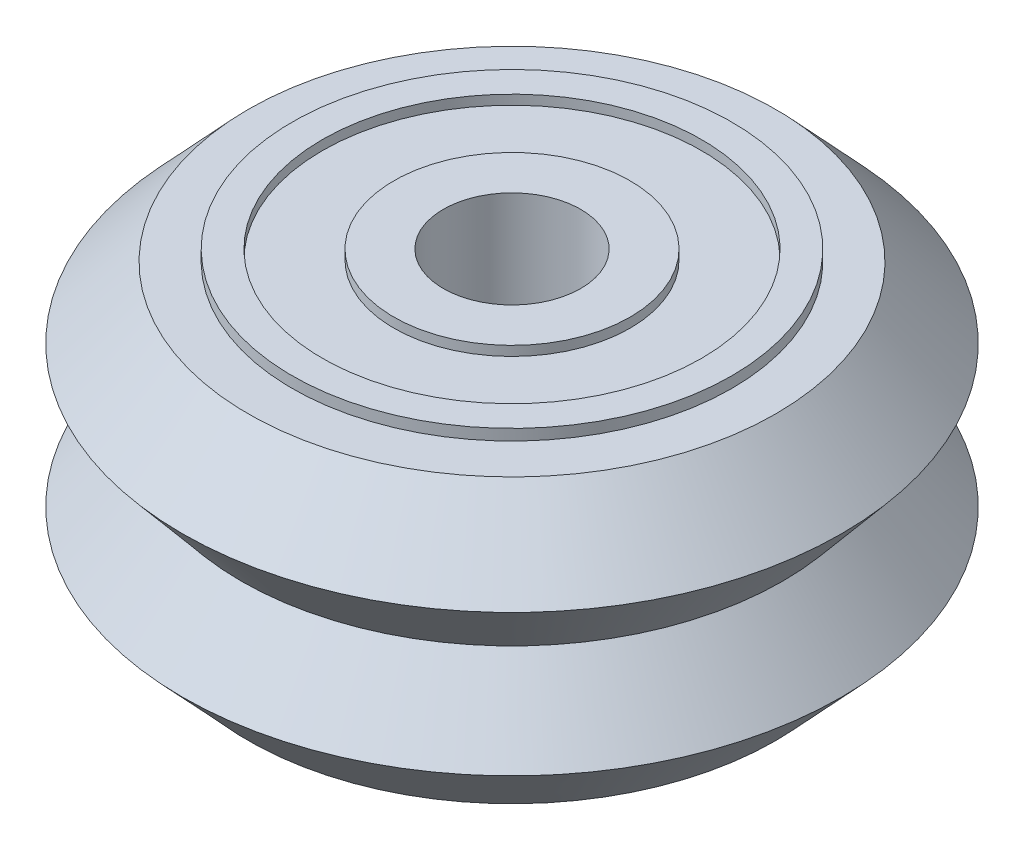
ISO-10303-21;
HEADER;
FILE_DESCRIPTION(('STEP AP214'),'2;1');
FILE_NAME('part.step','',(''),(''),'','','');
FILE_SCHEMA(('AUTOMOTIVE_DESIGN { 1 0 10303 214 1 1 1 1 }'));
ENDSEC;
DATA;
#1=APPLICATION_CONTEXT('core data for automotive mechanical design processes');
#2=APPLICATION_PROTOCOL_DEFINITION('international standard','automotive_design',2000,#1);
#3=PRODUCT_CONTEXT('',#1,'mechanical');
#4=PRODUCT('Part','Part','',(#3));
#5=PRODUCT_RELATED_PRODUCT_CATEGORY('part','',(#4));
#6=PRODUCT_DEFINITION_FORMATION('','',#4);
#7=PRODUCT_DEFINITION_CONTEXT('part definition',#1,'design');
#8=PRODUCT_DEFINITION('design','',#6,#7);
#9=PRODUCT_DEFINITION_SHAPE('','',#8);
#10=(LENGTH_UNIT() NAMED_UNIT(*) SI_UNIT(.MILLI.,.METRE.));
#11=(NAMED_UNIT(*) PLANE_ANGLE_UNIT() SI_UNIT($,.RADIAN.));
#12=(NAMED_UNIT(*) SI_UNIT($,.STERADIAN.) SOLID_ANGLE_UNIT());
#13=UNCERTAINTY_MEASURE_WITH_UNIT(LENGTH_MEASURE(1.E-05),#10,'distance_accuracy_value','');
#14=(GEOMETRIC_REPRESENTATION_CONTEXT(3) GLOBAL_UNCERTAINTY_ASSIGNED_CONTEXT((#13)) GLOBAL_UNIT_ASSIGNED_CONTEXT((#10,
#11,#12)) REPRESENTATION_CONTEXT('',''));
#15=CARTESIAN_POINT('',(0.,0.,0.));
#16=DIRECTION('',(0.,0.,1.));
#17=DIRECTION('',(1.,0.,0.));
#18=AXIS2_PLACEMENT_3D('',#15,#16,#17);
#19=CARTESIAN_POINT('',(0.,-5.55,-8.));
#20=DIRECTION('',(0.,1.,0.));
#21=DIRECTION('',(1.,0.,0.));
#22=AXIS2_PLACEMENT_3D('',#19,#20,#21);
#23=PLANE('',#22);
#24=CARTESIAN_POINT('',(0.,-5.55,0.));
#25=DIRECTION('',(0.,1.,0.));
#26=DIRECTION('',(1.,0.,0.));
#27=AXIS2_PLACEMENT_3D('',#24,#25,#26);
#28=CIRCLE('',#27,8.);
#29=CARTESIAN_POINT('',(8.,-5.55,0.));
#30=VERTEX_POINT('',#29);
#31=EDGE_CURVE('P0_E54',#30,#30,#28,.T.);
#32=ORIENTED_EDGE('',*,*,#31,.F.);
#33=EDGE_LOOP('',(#32));
#34=FACE_BOUND('',#33,.T.);
#35=CARTESIAN_POINT('',(0.,-5.55,0.));
#36=DIRECTION('',(0.,1.,0.));
#37=DIRECTION('',(1.,0.,0.));
#38=AXIS2_PLACEMENT_3D('',#35,#36,#37);
#39=CIRCLE('',#38,6.9);
#40=CARTESIAN_POINT('',(6.9,-5.55,0.));
#41=VERTEX_POINT('',#40);
#42=EDGE_CURVE('P0_E9',#41,#41,#39,.T.);
#43=ORIENTED_EDGE('',*,*,#42,.T.);
#44=EDGE_LOOP('',(#43));
#45=FACE_BOUND('',#44,.T.);
#46=ADVANCED_FACE('P0_F14',(#34,#45),#23,.F.);
#47=CARTESIAN_POINT('',(0.,8.97867383512545,0.));
#48=DIRECTION('',(0.,1.,0.));
#49=DIRECTION('',(1.,0.,0.));
#50=AXIS2_PLACEMENT_3D('',#47,#48,#49);
#51=CYLINDRICAL_SURFACE('',#50,6.9);
#52=ORIENTED_EDGE('',*,*,#42,.F.);
#53=EDGE_LOOP('',(#52));
#54=FACE_BOUND('',#53,.T.);
#55=CARTESIAN_POINT('',(0.,-5.2,0.));
#56=DIRECTION('',(0.,1.,0.));
#57=DIRECTION('',(1.,0.,0.));
#58=AXIS2_PLACEMENT_3D('',#55,#56,#57);
#59=CIRCLE('',#58,6.9);
#60=CARTESIAN_POINT('',(6.9,-5.2,0.));
#61=VERTEX_POINT('',#60);
#62=EDGE_CURVE('P0_E20',#61,#61,#59,.T.);
#63=ORIENTED_EDGE('',*,*,#62,.T.);
#64=EDGE_LOOP('',(#63));
#65=FACE_BOUND('',#64,.T.);
#66=ADVANCED_FACE('P0_F61',(#54,#65),#51,.F.);
#67=CARTESIAN_POINT('',(0.,-5.2,-6.9));
#68=DIRECTION('',(0.,1.,0.));
#69=DIRECTION('',(1.,0.,0.));
#70=AXIS2_PLACEMENT_3D('',#67,#68,#69);
#71=PLANE('',#70);
#72=ORIENTED_EDGE('',*,*,#62,.F.);
#73=EDGE_LOOP('',(#72));
#74=FACE_BOUND('',#73,.T.);
#75=CARTESIAN_POINT('',(0.,-5.2,0.));
#76=DIRECTION('',(0.,1.,0.));
#77=DIRECTION('',(1.,0.,0.));
#78=AXIS2_PLACEMENT_3D('',#75,#76,#77);
#79=CIRCLE('',#78,4.3);
#80=CARTESIAN_POINT('',(4.3,-5.2,0.));
#81=VERTEX_POINT('',#80);
#82=EDGE_CURVE('P0_E24',#81,#81,#79,.T.);
#83=ORIENTED_EDGE('',*,*,#82,.T.);
#84=EDGE_LOOP('',(#83));
#85=FACE_BOUND('',#84,.T.);
#86=ADVANCED_FACE('P0_F66',(#74,#85),#71,.F.);
#87=CARTESIAN_POINT('',(0.,8.97867383512545,0.));
#88=DIRECTION('',(0.,1.,0.));
#89=DIRECTION('',(1.,0.,0.));
#90=AXIS2_PLACEMENT_3D('',#87,#88,#89);
#91=CYLINDRICAL_SURFACE('',#90,4.3);
#92=ORIENTED_EDGE('',*,*,#82,.F.);
#93=EDGE_LOOP('',(#92));
#94=FACE_BOUND('',#93,.T.);
#95=CARTESIAN_POINT('',(0.,-5.55,0.));
#96=DIRECTION('',(0.,1.,0.));
#97=DIRECTION('',(1.,0.,0.));
#98=AXIS2_PLACEMENT_3D('',#95,#96,#97);
#99=CIRCLE('',#98,4.3);
#100=CARTESIAN_POINT('',(4.3,-5.55,0.));
#101=VERTEX_POINT('',#100);
#102=EDGE_CURVE('P0_E28',#101,#101,#99,.T.);
#103=ORIENTED_EDGE('',*,*,#102,.T.);
#104=EDGE_LOOP('',(#103));
#105=FACE_BOUND('',#104,.T.);
#106=ADVANCED_FACE('P0_F71',(#94,#105),#91,.T.);
#107=CARTESIAN_POINT('',(0.,-5.55,-4.3));
#108=DIRECTION('',(0.,1.,0.));
#109=DIRECTION('',(1.,0.,0.));
#110=AXIS2_PLACEMENT_3D('',#107,#108,#109);
#111=PLANE('',#110);
#112=ORIENTED_EDGE('',*,*,#102,.F.);
#113=EDGE_LOOP('',(#112));
#114=FACE_BOUND('',#113,.T.);
#115=CARTESIAN_POINT('',(0.,-5.55,0.));
#116=DIRECTION('',(0.,1.,0.));
#117=DIRECTION('',(1.,0.,0.));
#118=AXIS2_PLACEMENT_3D('',#115,#116,#117);
#119=CIRCLE('',#118,2.5);
#120=CARTESIAN_POINT('',(2.5,-5.55,0.));
#121=VERTEX_POINT('',#120);
#122=EDGE_CURVE('P0_E33',#121,#121,#119,.T.);
#123=ORIENTED_EDGE('',*,*,#122,.T.);
#124=EDGE_LOOP('',(#123));
#125=FACE_BOUND('',#124,.T.);
#126=ADVANCED_FACE('P0_F77',(#114,#125),#111,.F.);
#127=CARTESIAN_POINT('',(0.,8.97867383512545,0.));
#128=DIRECTION('',(0.,1.,0.));
#129=DIRECTION('',(1.,0.,0.));
#130=AXIS2_PLACEMENT_3D('',#127,#128,#129);
#131=CYLINDRICAL_SURFACE('',#130,2.5);
#132=ORIENTED_EDGE('',*,*,#122,.F.);
#133=EDGE_LOOP('',(#132));
#134=FACE_BOUND('',#133,.T.);
#135=CARTESIAN_POINT('',(0.,-0.55,0.));
#136=DIRECTION('',(0.,1.,0.));
#137=DIRECTION('',(1.,0.,0.));
#138=AXIS2_PLACEMENT_3D('',#135,#136,#137);
#139=CIRCLE('',#138,2.5);
#140=CARTESIAN_POINT('',(2.5,-0.55,0.));
#141=VERTEX_POINT('',#140);
#142=EDGE_CURVE('P0_E36',#141,#141,#139,.T.);
#143=ORIENTED_EDGE('',*,*,#142,.T.);
#144=EDGE_LOOP('',(#143));
#145=FACE_BOUND('',#144,.T.);
#146=ADVANCED_FACE('P0_F81',(#134,#145),#131,.F.);
#147=CARTESIAN_POINT('',(0.,-0.549999999999999,-4.3));
#148=DIRECTION('',(0.,-1.,0.));
#149=DIRECTION('',(-1.,0.,0.));
#150=AXIS2_PLACEMENT_3D('',#147,#148,#149);
#151=PLANE('',#150);
#152=ORIENTED_EDGE('',*,*,#142,.F.);
#153=EDGE_LOOP('',(#152));
#154=FACE_BOUND('',#153,.T.);
#155=CARTESIAN_POINT('',(0.,-0.55,0.));
#156=DIRECTION('',(0.,1.,0.));
#157=DIRECTION('',(1.,0.,0.));
#158=AXIS2_PLACEMENT_3D('',#155,#156,#157);
#159=CIRCLE('',#158,4.3);
#160=CARTESIAN_POINT('',(4.3,-0.55,0.));
#161=VERTEX_POINT('',#160);
#162=EDGE_CURVE('P0_E39',#161,#161,#159,.T.);
#163=ORIENTED_EDGE('',*,*,#162,.T.);
#164=EDGE_LOOP('',(#163));
#165=FACE_BOUND('',#164,.T.);
#166=ADVANCED_FACE('P0_F85',(#154,#165),#151,.F.);
#167=CARTESIAN_POINT('',(0.,8.97867383512545,0.));
#168=DIRECTION('',(0.,1.,0.));
#169=DIRECTION('',(1.,0.,0.));
#170=AXIS2_PLACEMENT_3D('',#167,#168,#169);
#171=CYLINDRICAL_SURFACE('',#170,4.3);
#172=ORIENTED_EDGE('',*,*,#162,.F.);
#173=EDGE_LOOP('',(#172));
#174=FACE_BOUND('',#173,.T.);
#175=CARTESIAN_POINT('',(0.,-0.9,0.));
#176=DIRECTION('',(0.,1.,0.));
#177=DIRECTION('',(1.,0.,0.));
#178=AXIS2_PLACEMENT_3D('',#175,#176,#177);
#179=CIRCLE('',#178,4.3);
#180=CARTESIAN_POINT('',(4.3,-0.9,0.));
#181=VERTEX_POINT('',#180);
#182=EDGE_CURVE('P0_E42',#181,#181,#179,.T.);
#183=ORIENTED_EDGE('',*,*,#182,.T.);
#184=EDGE_LOOP('',(#183));
#185=FACE_BOUND('',#184,.T.);
#186=ADVANCED_FACE('P0_F89',(#174,#185),#171,.T.);
#187=CARTESIAN_POINT('',(0.,-0.900000000000001,-6.9));
#188=DIRECTION('',(0.,-1.,0.));
#189=DIRECTION('',(-1.,0.,0.));
#190=AXIS2_PLACEMENT_3D('',#187,#188,#189);
#191=PLANE('',#190);
#192=ORIENTED_EDGE('',*,*,#182,.F.);
#193=EDGE_LOOP('',(#192));
#194=FACE_BOUND('',#193,.T.);
#195=CARTESIAN_POINT('',(0.,-0.9,0.));
#196=DIRECTION('',(0.,1.,0.));
#197=DIRECTION('',(1.,0.,0.));
#198=AXIS2_PLACEMENT_3D('',#195,#196,#197);
#199=CIRCLE('',#198,6.9);
#200=CARTESIAN_POINT('',(6.9,-0.9,0.));
#201=VERTEX_POINT('',#200);
#202=EDGE_CURVE('P0_E45',#201,#201,#199,.T.);
#203=ORIENTED_EDGE('',*,*,#202,.T.);
#204=EDGE_LOOP('',(#203));
#205=FACE_BOUND('',#204,.T.);
#206=ADVANCED_FACE('P0_F93',(#194,#205),#191,.F.);
#207=CARTESIAN_POINT('',(0.,8.97867383512545,0.));
#208=DIRECTION('',(0.,1.,0.));
#209=DIRECTION('',(1.,0.,0.));
#210=AXIS2_PLACEMENT_3D('',#207,#208,#209);
#211=CYLINDRICAL_SURFACE('',#210,6.9);
#212=ORIENTED_EDGE('',*,*,#202,.F.);
#213=EDGE_LOOP('',(#212));
#214=FACE_BOUND('',#213,.T.);
#215=CARTESIAN_POINT('',(0.,-0.55,0.));
#216=DIRECTION('',(0.,1.,0.));
#217=DIRECTION('',(1.,0.,0.));
#218=AXIS2_PLACEMENT_3D('',#215,#216,#217);
#219=CIRCLE('',#218,6.9);
#220=CARTESIAN_POINT('',(6.9,-0.55,0.));
#221=VERTEX_POINT('',#220);
#222=EDGE_CURVE('P0_E48',#221,#221,#219,.T.);
#223=ORIENTED_EDGE('',*,*,#222,.T.);
#224=EDGE_LOOP('',(#223));
#225=FACE_BOUND('',#224,.T.);
#226=ADVANCED_FACE('P0_F97',(#214,#225),#211,.F.);
#227=CARTESIAN_POINT('',(0.,-0.55,-8.));
#228=DIRECTION('',(0.,-1.,0.));
#229=DIRECTION('',(-1.,0.,0.));
#230=AXIS2_PLACEMENT_3D('',#227,#228,#229);
#231=PLANE('',#230);
#232=ORIENTED_EDGE('',*,*,#222,.F.);
#233=EDGE_LOOP('',(#232));
#234=FACE_BOUND('',#233,.T.);
#235=CARTESIAN_POINT('',(0.,-0.55,0.));
#236=DIRECTION('',(0.,1.,0.));
#237=DIRECTION('',(1.,0.,0.));
#238=AXIS2_PLACEMENT_3D('',#235,#236,#237);
#239=CIRCLE('',#238,8.);
#240=CARTESIAN_POINT('',(8.,-0.55,0.));
#241=VERTEX_POINT('',#240);
#242=EDGE_CURVE('P0_E51',#241,#241,#239,.T.);
#243=ORIENTED_EDGE('',*,*,#242,.T.);
#244=EDGE_LOOP('',(#243));
#245=FACE_BOUND('',#244,.T.);
#246=ADVANCED_FACE('P0_F101',(#234,#245),#231,.F.);
#247=CARTESIAN_POINT('',(0.,8.97867383512545,0.));
#248=DIRECTION('',(0.,1.,0.));
#249=DIRECTION('',(1.,0.,0.));
#250=AXIS2_PLACEMENT_3D('',#247,#248,#249);
#251=CYLINDRICAL_SURFACE('',#250,8.);
#252=ORIENTED_EDGE('',*,*,#242,.F.);
#253=EDGE_LOOP('',(#252));
#254=FACE_BOUND('',#253,.T.);
#255=ORIENTED_EDGE('',*,*,#31,.T.);
#256=EDGE_LOOP('',(#255));
#257=FACE_BOUND('',#256,.T.);
#258=ADVANCED_FACE('P0_F58',(#254,#257),#251,.T.);
#259=CLOSED_SHELL('',(#46,#66,#86,#106,#126,#146,#166,#186,#206,#226,#246,#258));
#260=MANIFOLD_SOLID_BREP('P0_B1',#259);
#261=CARTESIAN_POINT('',(0.,0.55,-8.));
#262=DIRECTION('',(0.,1.,0.));
#263=DIRECTION('',(1.,0.,0.));
#264=AXIS2_PLACEMENT_3D('',#261,#262,#263);
#265=PLANE('',#264);
#266=CARTESIAN_POINT('',(0.,0.55,0.));
#267=DIRECTION('',(0.,1.,0.));
#268=DIRECTION('',(1.,0.,0.));
#269=AXIS2_PLACEMENT_3D('',#266,#267,#268);
#270=CIRCLE('',#269,8.);
#271=CARTESIAN_POINT('',(8.,0.55,0.));
#272=VERTEX_POINT('',#271);
#273=EDGE_CURVE('P1_E55',#272,#272,#270,.T.);
#274=ORIENTED_EDGE('',*,*,#273,.F.);
#275=EDGE_LOOP('',(#274));
#276=FACE_BOUND('',#275,.T.);
#277=CARTESIAN_POINT('',(0.,0.55,0.));
#278=DIRECTION('',(0.,1.,0.));
#279=DIRECTION('',(1.,0.,0.));
#280=AXIS2_PLACEMENT_3D('',#277,#278,#279);
#281=CIRCLE('',#280,6.9);
#282=CARTESIAN_POINT('',(6.9,0.55,0.));
#283=VERTEX_POINT('',#282);
#284=EDGE_CURVE('P1_E10',#283,#283,#281,.T.);
#285=ORIENTED_EDGE('',*,*,#284,.T.);
#286=EDGE_LOOP('',(#285));
#287=FACE_BOUND('',#286,.T.);
#288=ADVANCED_FACE('P1_F15',(#276,#287),#265,.F.);
#289=CARTESIAN_POINT('',(0.,15.0786738351254,0.));
#290=DIRECTION('',(0.,1.,0.));
#291=DIRECTION('',(1.,0.,0.));
#292=AXIS2_PLACEMENT_3D('',#289,#290,#291);
#293=CYLINDRICAL_SURFACE('',#292,6.9);
#294=ORIENTED_EDGE('',*,*,#284,.F.);
#295=EDGE_LOOP('',(#294));
#296=FACE_BOUND('',#295,.T.);
#297=CARTESIAN_POINT('',(0.,0.9,0.));
#298=DIRECTION('',(0.,1.,0.));
#299=DIRECTION('',(1.,0.,0.));
#300=AXIS2_PLACEMENT_3D('',#297,#298,#299);
#301=CIRCLE('',#300,6.9);
#302=CARTESIAN_POINT('',(6.9,0.9,0.));
#303=VERTEX_POINT('',#302);
#304=EDGE_CURVE('P1_E21',#303,#303,#301,.T.);
#305=ORIENTED_EDGE('',*,*,#304,.T.);
#306=EDGE_LOOP('',(#305));
#307=FACE_BOUND('',#306,.T.);
#308=ADVANCED_FACE('P1_F62',(#296,#307),#293,.F.);
#309=CARTESIAN_POINT('',(0.,0.900000000000001,-6.9));
#310=DIRECTION('',(0.,1.,0.));
#311=DIRECTION('',(1.,0.,0.));
#312=AXIS2_PLACEMENT_3D('',#309,#310,#311);
#313=PLANE('',#312);
#314=ORIENTED_EDGE('',*,*,#304,.F.);
#315=EDGE_LOOP('',(#314));
#316=FACE_BOUND('',#315,.T.);
#317=CARTESIAN_POINT('',(0.,0.9,0.));
#318=DIRECTION('',(0.,1.,0.));
#319=DIRECTION('',(1.,0.,0.));
#320=AXIS2_PLACEMENT_3D('',#317,#318,#319);
#321=CIRCLE('',#320,4.3);
#322=CARTESIAN_POINT('',(4.3,0.9,0.));
#323=VERTEX_POINT('',#322);
#324=EDGE_CURVE('P1_E25',#323,#323,#321,.T.);
#325=ORIENTED_EDGE('',*,*,#324,.T.);
#326=EDGE_LOOP('',(#325));
#327=FACE_BOUND('',#326,.T.);
#328=ADVANCED_FACE('P1_F67',(#316,#327),#313,.F.);
#329=CARTESIAN_POINT('',(0.,15.0786738351254,0.));
#330=DIRECTION('',(0.,1.,0.));
#331=DIRECTION('',(1.,0.,0.));
#332=AXIS2_PLACEMENT_3D('',#329,#330,#331);
#333=CYLINDRICAL_SURFACE('',#332,4.3);
#334=ORIENTED_EDGE('',*,*,#324,.F.);
#335=EDGE_LOOP('',(#334));
#336=FACE_BOUND('',#335,.T.);
#337=CARTESIAN_POINT('',(0.,0.55,0.));
#338=DIRECTION('',(0.,1.,0.));
#339=DIRECTION('',(1.,0.,0.));
#340=AXIS2_PLACEMENT_3D('',#337,#338,#339);
#341=CIRCLE('',#340,4.3);
#342=CARTESIAN_POINT('',(4.3,0.55,0.));
#343=VERTEX_POINT('',#342);
#344=EDGE_CURVE('P1_E29',#343,#343,#341,.T.);
#345=ORIENTED_EDGE('',*,*,#344,.T.);
#346=EDGE_LOOP('',(#345));
#347=FACE_BOUND('',#346,.T.);
#348=ADVANCED_FACE('P1_F72',(#336,#347),#333,.T.);
#349=CARTESIAN_POINT('',(0.,0.549999999999999,-4.3));
#350=DIRECTION('',(0.,1.,0.));
#351=DIRECTION('',(1.,0.,0.));
#352=AXIS2_PLACEMENT_3D('',#349,#350,#351);
#353=PLANE('',#352);
#354=ORIENTED_EDGE('',*,*,#344,.F.);
#355=EDGE_LOOP('',(#354));
#356=FACE_BOUND('',#355,.T.);
#357=CARTESIAN_POINT('',(0.,0.55,0.));
#358=DIRECTION('',(0.,1.,0.));
#359=DIRECTION('',(1.,0.,0.));
#360=AXIS2_PLACEMENT_3D('',#357,#358,#359);
#361=CIRCLE('',#360,2.5);
#362=CARTESIAN_POINT('',(2.5,0.55,0.));
#363=VERTEX_POINT('',#362);
#364=EDGE_CURVE('P1_E34',#363,#363,#361,.T.);
#365=ORIENTED_EDGE('',*,*,#364,.T.);
#366=EDGE_LOOP('',(#365));
#367=FACE_BOUND('',#366,.T.);
#368=ADVANCED_FACE('P1_F78',(#356,#367),#353,.F.);
#369=CARTESIAN_POINT('',(0.,15.0786738351254,0.));
#370=DIRECTION('',(0.,1.,0.));
#371=DIRECTION('',(1.,0.,0.));
#372=AXIS2_PLACEMENT_3D('',#369,#370,#371);
#373=CYLINDRICAL_SURFACE('',#372,2.5);
#374=ORIENTED_EDGE('',*,*,#364,.F.);
#375=EDGE_LOOP('',(#374));
#376=FACE_BOUND('',#375,.T.);
#377=CARTESIAN_POINT('',(0.,5.55,0.));
#378=DIRECTION('',(0.,1.,0.));
#379=DIRECTION('',(1.,0.,0.));
#380=AXIS2_PLACEMENT_3D('',#377,#378,#379);
#381=CIRCLE('',#380,2.5);
#382=CARTESIAN_POINT('',(2.5,5.55,0.));
#383=VERTEX_POINT('',#382);
#384=EDGE_CURVE('P1_E37',#383,#383,#381,.T.);
#385=ORIENTED_EDGE('',*,*,#384,.T.);
#386=EDGE_LOOP('',(#385));
#387=FACE_BOUND('',#386,.T.);
#388=ADVANCED_FACE('P1_F82',(#376,#387),#373,.F.);
#389=CARTESIAN_POINT('',(0.,5.55,-4.3));
#390=DIRECTION('',(0.,-1.,0.));
#391=DIRECTION('',(-1.,0.,0.));
#392=AXIS2_PLACEMENT_3D('',#389,#390,#391);
#393=PLANE('',#392);
#394=ORIENTED_EDGE('',*,*,#384,.F.);
#395=EDGE_LOOP('',(#394));
#396=FACE_BOUND('',#395,.T.);
#397=CARTESIAN_POINT('',(0.,5.55,0.));
#398=DIRECTION('',(0.,1.,0.));
#399=DIRECTION('',(1.,0.,0.));
#400=AXIS2_PLACEMENT_3D('',#397,#398,#399);
#401=CIRCLE('',#400,4.3);
#402=CARTESIAN_POINT('',(4.3,5.55,0.));
#403=VERTEX_POINT('',#402);
#404=EDGE_CURVE('P1_E40',#403,#403,#401,.T.);
#405=ORIENTED_EDGE('',*,*,#404,.T.);
#406=EDGE_LOOP('',(#405));
#407=FACE_BOUND('',#406,.T.);
#408=ADVANCED_FACE('P1_F86',(#396,#407),#393,.F.);
#409=CARTESIAN_POINT('',(0.,15.0786738351254,0.));
#410=DIRECTION('',(0.,1.,0.));
#411=DIRECTION('',(1.,0.,0.));
#412=AXIS2_PLACEMENT_3D('',#409,#410,#411);
#413=CYLINDRICAL_SURFACE('',#412,4.3);
#414=ORIENTED_EDGE('',*,*,#404,.F.);
#415=EDGE_LOOP('',(#414));
#416=FACE_BOUND('',#415,.T.);
#417=CARTESIAN_POINT('',(0.,5.2,0.));
#418=DIRECTION('',(0.,1.,0.));
#419=DIRECTION('',(1.,0.,0.));
#420=AXIS2_PLACEMENT_3D('',#417,#418,#419);
#421=CIRCLE('',#420,4.3);
#422=CARTESIAN_POINT('',(4.3,5.2,0.));
#423=VERTEX_POINT('',#422);
#424=EDGE_CURVE('P1_E43',#423,#423,#421,.T.);
#425=ORIENTED_EDGE('',*,*,#424,.T.);
#426=EDGE_LOOP('',(#425));
#427=FACE_BOUND('',#426,.T.);
#428=ADVANCED_FACE('P1_F90',(#416,#427),#413,.T.);
#429=CARTESIAN_POINT('',(0.,5.2,-6.9));
#430=DIRECTION('',(0.,-1.,0.));
#431=DIRECTION('',(-1.,0.,0.));
#432=AXIS2_PLACEMENT_3D('',#429,#430,#431);
#433=PLANE('',#432);
#434=ORIENTED_EDGE('',*,*,#424,.F.);
#435=EDGE_LOOP('',(#434));
#436=FACE_BOUND('',#435,.T.);
#437=CARTESIAN_POINT('',(0.,5.2,0.));
#438=DIRECTION('',(0.,1.,0.));
#439=DIRECTION('',(1.,0.,0.));
#440=AXIS2_PLACEMENT_3D('',#437,#438,#439);
#441=CIRCLE('',#440,6.9);
#442=CARTESIAN_POINT('',(6.9,5.2,0.));
#443=VERTEX_POINT('',#442);
#444=EDGE_CURVE('P1_E46',#443,#443,#441,.T.);
#445=ORIENTED_EDGE('',*,*,#444,.T.);
#446=EDGE_LOOP('',(#445));
#447=FACE_BOUND('',#446,.T.);
#448=ADVANCED_FACE('P1_F94',(#436,#447),#433,.F.);
#449=CARTESIAN_POINT('',(0.,15.0786738351254,0.));
#450=DIRECTION('',(0.,1.,0.));
#451=DIRECTION('',(1.,0.,0.));
#452=AXIS2_PLACEMENT_3D('',#449,#450,#451);
#453=CYLINDRICAL_SURFACE('',#452,6.9);
#454=ORIENTED_EDGE('',*,*,#444,.F.);
#455=EDGE_LOOP('',(#454));
#456=FACE_BOUND('',#455,.T.);
#457=CARTESIAN_POINT('',(0.,5.55,0.));
#458=DIRECTION('',(0.,1.,0.));
#459=DIRECTION('',(1.,0.,0.));
#460=AXIS2_PLACEMENT_3D('',#457,#458,#459);
#461=CIRCLE('',#460,6.9);
#462=CARTESIAN_POINT('',(6.9,5.55,0.));
#463=VERTEX_POINT('',#462);
#464=EDGE_CURVE('P1_E49',#463,#463,#461,.T.);
#465=ORIENTED_EDGE('',*,*,#464,.T.);
#466=EDGE_LOOP('',(#465));
#467=FACE_BOUND('',#466,.T.);
#468=ADVANCED_FACE('P1_F98',(#456,#467),#453,.F.);
#469=CARTESIAN_POINT('',(0.,5.55,-8.));
#470=DIRECTION('',(0.,-1.,0.));
#471=DIRECTION('',(-1.,0.,0.));
#472=AXIS2_PLACEMENT_3D('',#469,#470,#471);
#473=PLANE('',#472);
#474=ORIENTED_EDGE('',*,*,#464,.F.);
#475=EDGE_LOOP('',(#474));
#476=FACE_BOUND('',#475,.T.);
#477=CARTESIAN_POINT('',(0.,5.55,0.));
#478=DIRECTION('',(0.,1.,0.));
#479=DIRECTION('',(1.,0.,0.));
#480=AXIS2_PLACEMENT_3D('',#477,#478,#479);
#481=CIRCLE('',#480,8.);
#482=CARTESIAN_POINT('',(8.,5.55,0.));
#483=VERTEX_POINT('',#482);
#484=EDGE_CURVE('P1_E52',#483,#483,#481,.T.);
#485=ORIENTED_EDGE('',*,*,#484,.T.);
#486=EDGE_LOOP('',(#485));
#487=FACE_BOUND('',#486,.T.);
#488=ADVANCED_FACE('P1_F102',(#476,#487),#473,.F.);
#489=CARTESIAN_POINT('',(0.,15.0786738351254,0.));
#490=DIRECTION('',(0.,1.,0.));
#491=DIRECTION('',(1.,0.,0.));
#492=AXIS2_PLACEMENT_3D('',#489,#490,#491);
#493=CYLINDRICAL_SURFACE('',#492,8.);
#494=ORIENTED_EDGE('',*,*,#484,.F.);
#495=EDGE_LOOP('',(#494));
#496=FACE_BOUND('',#495,.T.);
#497=ORIENTED_EDGE('',*,*,#273,.T.);
#498=EDGE_LOOP('',(#497));
#499=FACE_BOUND('',#498,.T.);
#500=ADVANCED_FACE('P1_F59',(#496,#499),#493,.T.);
#501=CLOSED_SHELL('',(#288,#308,#328,#348,#368,#388,#408,#428,#448,#468,#488,#500));
#502=MANIFOLD_SOLID_BREP('P1_B1',#501);
#503=CARTESIAN_POINT('',(0.,-0.499999999999998,0.));
#504=DIRECTION('',(0.,1.,0.));
#505=DIRECTION('',(-1.,0.,0.));
#506=AXIS2_PLACEMENT_3D('',#503,#504,#505);
#507=CYLINDRICAL_SURFACE('',#506,2.6);
#508=CARTESIAN_POINT('',(0.,-0.499999999999998,0.));
#509=DIRECTION('',(0.,1.,0.));
#510=DIRECTION('',(-1.,0.,0.));
#511=AXIS2_PLACEMENT_3D('',#508,#509,#510);
#512=CIRCLE('',#511,2.6);
#513=CARTESIAN_POINT('',(2.6,-0.499999999999998,0.));
#514=VERTEX_POINT('',#513);
#515=EDGE_CURVE('P2_E39',#514,#514,#512,.T.);
#516=ORIENTED_EDGE('',*,*,#515,.F.);
#517=DIRECTION('',(0.,1.,0.));
#518=VECTOR('',#517,1.);
#519=CARTESIAN_POINT('',(2.6,-0.499999999999998,0.));
#520=LINE('',#519,#518);
#521=CARTESIAN_POINT('',(2.6,0.500000000000002,0.));
#522=VERTEX_POINT('',#521);
#523=EDGE_CURVE('P2_E11',#514,#522,#520,.T.);
#524=ORIENTED_EDGE('',*,*,#523,.T.);
#525=CARTESIAN_POINT('',(0.,0.500000000000002,0.));
#526=DIRECTION('',(0.,-1.,0.));
#527=DIRECTION('',(-1.,0.,0.));
#528=AXIS2_PLACEMENT_3D('',#525,#526,#527);
#529=CIRCLE('',#528,2.6);
#530=EDGE_CURVE('P2_E69',#522,#522,#529,.T.);
#531=ORIENTED_EDGE('',*,*,#530,.F.);
#532=ORIENTED_EDGE('',*,*,#523,.F.);
#533=EDGE_LOOP('',(#516,#524,#531,#532));
#534=FACE_BOUND('',#533,.T.);
#535=ADVANCED_FACE('P2_F17',(#534),#507,.F.);
#536=CARTESIAN_POINT('',(0.,-0.499999999999998,0.));
#537=DIRECTION('',(0.,1.,0.));
#538=DIRECTION('',(-1.,0.,0.));
#539=AXIS2_PLACEMENT_3D('',#536,#537,#538);
#540=CYLINDRICAL_SURFACE('',#539,5.);
#541=CARTESIAN_POINT('',(0.,0.500000000000002,0.));
#542=DIRECTION('',(0.,1.,0.));
#543=DIRECTION('',(-1.,0.,0.));
#544=AXIS2_PLACEMENT_3D('',#541,#542,#543);
#545=CIRCLE('',#544,5.);
#546=CARTESIAN_POINT('',(5.,0.500000000000002,0.));
#547=VERTEX_POINT('',#546);
#548=EDGE_CURVE('P2_E52',#547,#547,#545,.T.);
#549=ORIENTED_EDGE('',*,*,#548,.F.);
#550=DIRECTION('',(0.,-1.,0.));
#551=VECTOR('',#550,1.);
#552=CARTESIAN_POINT('',(5.,-0.499999999999998,0.));
#553=LINE('',#552,#551);
#554=CARTESIAN_POINT('',(5.,-0.499999999999998,0.));
#555=VERTEX_POINT('',#554);
#556=EDGE_CURVE('P2_E21',#547,#555,#553,.T.);
#557=ORIENTED_EDGE('',*,*,#556,.T.);
#558=CARTESIAN_POINT('',(0.,-0.499999999999998,0.));
#559=DIRECTION('',(0.,-1.,0.));
#560=DIRECTION('',(-1.,0.,0.));
#561=AXIS2_PLACEMENT_3D('',#558,#559,#560);
#562=CIRCLE('',#561,5.);
#563=EDGE_CURVE('P2_E57',#555,#555,#562,.T.);
#564=ORIENTED_EDGE('',*,*,#563,.F.);
#565=ORIENTED_EDGE('',*,*,#556,.F.);
#566=EDGE_LOOP('',(#549,#557,#564,#565));
#567=FACE_BOUND('',#566,.T.);
#568=ADVANCED_FACE('P2_F58',(#567),#540,.T.);
#569=CARTESIAN_POINT('',(0.,-0.499999999999998,0.));
#570=DIRECTION('',(0.,1.,0.));
#571=DIRECTION('',(1.,0.,0.));
#572=AXIS2_PLACEMENT_3D('',#569,#570,#571);
#573=PLANE('',#572);
#574=ORIENTED_EDGE('',*,*,#563,.T.);
#575=EDGE_LOOP('',(#574));
#576=FACE_BOUND('',#575,.T.);
#577=ORIENTED_EDGE('',*,*,#515,.T.);
#578=EDGE_LOOP('',(#577));
#579=FACE_BOUND('',#578,.T.);
#580=ADVANCED_FACE('P2_F80',(#576,#579),#573,.F.);
#581=CARTESIAN_POINT('',(0.,0.500000000000002,0.));
#582=DIRECTION('',(0.,1.,0.));
#583=DIRECTION('',(1.,0.,0.));
#584=AXIS2_PLACEMENT_3D('',#581,#582,#583);
#585=PLANE('',#584);
#586=ORIENTED_EDGE('',*,*,#548,.T.);
#587=EDGE_LOOP('',(#586));
#588=FACE_BOUND('',#587,.T.);
#589=ORIENTED_EDGE('',*,*,#530,.T.);
#590=EDGE_LOOP('',(#589));
#591=FACE_BOUND('',#590,.T.);
#592=ADVANCED_FACE('P2_F19',(#588,#591),#585,.T.);
#593=CLOSED_SHELL('',(#535,#568,#580,#592));
#594=MANIFOLD_SOLID_BREP('P2_B1',#593);
#595=CARTESIAN_POINT('',(7.8,0.55,0.));
#596=DIRECTION('',(0.,1.,0.));
#597=DIRECTION('',(1.,0.,0.));
#598=AXIS2_PLACEMENT_3D('',#595,#596,#597);
#599=PLANE('',#598);
#600=CARTESIAN_POINT('',(0.,0.55,0.));
#601=DIRECTION('',(0.,-1.,0.));
#602=DIRECTION('',(1.,0.,0.));
#603=AXIS2_PLACEMENT_3D('',#600,#601,#602);
#604=CIRCLE('',#603,7.8);
#605=CARTESIAN_POINT('',(7.8,0.55,0.));
#606=VERTEX_POINT('',#605);
#607=CARTESIAN_POINT('',(-7.8,0.55,0.));
#608=VERTEX_POINT('',#607);
#609=EDGE_CURVE('P3_E41',#606,#608,#604,.T.);
#610=ORIENTED_EDGE('',*,*,#609,.F.);
#611=CARTESIAN_POINT('',(0.,0.55,0.));
#612=DIRECTION('',(0.,-1.,0.));
#613=DIRECTION('',(1.,0.,0.));
#614=AXIS2_PLACEMENT_3D('',#611,#612,#613);
#615=CIRCLE('',#614,7.8);
#616=EDGE_CURVE('P3_E189',#608,#606,#615,.T.);
#617=ORIENTED_EDGE('',*,*,#616,.F.);
#618=EDGE_LOOP('',(#610,#617));
#619=FACE_BOUND('',#618,.T.);
#620=CARTESIAN_POINT('',(0.,0.55,0.));
#621=DIRECTION('',(0.,-1.,0.));
#622=DIRECTION('',(1.,0.,0.));
#623=AXIS2_PLACEMENT_3D('',#620,#621,#622);
#624=CIRCLE('',#623,6.8);
#625=CARTESIAN_POINT('',(6.8,0.55,0.));
#626=VERTEX_POINT('',#625);
#627=CARTESIAN_POINT('',(-6.8,0.55,0.));
#628=VERTEX_POINT('',#627);
#629=EDGE_CURVE('P3_E11',#626,#628,#624,.T.);
#630=ORIENTED_EDGE('',*,*,#629,.T.);
#631=CARTESIAN_POINT('',(0.,0.55,0.));
#632=DIRECTION('',(0.,-1.,0.));
#633=DIRECTION('',(1.,0.,0.));
#634=AXIS2_PLACEMENT_3D('',#631,#632,#633);
#635=CIRCLE('',#634,6.8);
#636=EDGE_CURVE('P3_E28',#628,#626,#635,.T.);
#637=ORIENTED_EDGE('',*,*,#636,.T.);
#638=EDGE_LOOP('',(#630,#637));
#639=FACE_BOUND('',#638,.T.);
#640=ADVANCED_FACE('P3_F17',(#619,#639),#599,.T.);
#641=CARTESIAN_POINT('',(0.,2.85,0.));
#642=DIRECTION('',(0.,-1.,0.));
#643=DIRECTION('',(1.,0.,0.));
#644=AXIS2_PLACEMENT_3D('',#641,#642,#643);
#645=CYLINDRICAL_SURFACE('',#644,7.8);
#646=ORIENTED_EDGE('',*,*,#609,.T.);
#647=DIRECTION('',(0.,1.,0.));
#648=VECTOR('',#647,1.);
#649=CARTESIAN_POINT('',(-7.8,2.85,0.));
#650=LINE('',#649,#648);
#651=CARTESIAN_POINT('',(-7.8,5.15,0.));
#652=VERTEX_POINT('',#651);
#653=EDGE_CURVE('P3_E177',#608,#652,#650,.T.);
#654=ORIENTED_EDGE('',*,*,#653,.T.);
#655=CARTESIAN_POINT('',(0.,5.15,0.));
#656=DIRECTION('',(0.,-1.,0.));
#657=DIRECTION('',(1.,0.,0.));
#658=AXIS2_PLACEMENT_3D('',#655,#656,#657);
#659=CIRCLE('',#658,7.8);
#660=CARTESIAN_POINT('',(7.8,5.15,0.));
#661=VERTEX_POINT('',#660);
#662=EDGE_CURVE('P3_E193',#661,#652,#659,.T.);
#663=ORIENTED_EDGE('',*,*,#662,.F.);
#664=CARTESIAN_POINT('',(0.,5.15,0.));
#665=DIRECTION('',(0.,-1.,0.));
#666=DIRECTION('',(1.,0.,0.));
#667=AXIS2_PLACEMENT_3D('',#664,#665,#666);
#668=CIRCLE('',#667,7.8);
#669=EDGE_CURVE('P3_E138',#652,#661,#668,.T.);
#670=ORIENTED_EDGE('',*,*,#669,.F.);
#671=ORIENTED_EDGE('',*,*,#653,.F.);
#672=ORIENTED_EDGE('',*,*,#616,.T.);
#673=EDGE_LOOP('',(#646,#654,#663,#670,#671,#672));
#674=FACE_BOUND('',#673,.T.);
#675=ADVANCED_FACE('P3_F230',(#674),#645,.F.);
#676=CARTESIAN_POINT('',(9.6,5.15,0.));
#677=DIRECTION('',(0.,1.,0.));
#678=DIRECTION('',(1.,0.,0.));
#679=AXIS2_PLACEMENT_3D('',#676,#677,#678);
#680=PLANE('',#679);
#681=CARTESIAN_POINT('',(0.,5.15,0.));
#682=DIRECTION('',(0.,-1.,0.));
#683=DIRECTION('',(1.,0.,0.));
#684=AXIS2_PLACEMENT_3D('',#681,#682,#683);
#685=CIRCLE('',#684,9.6);
#686=CARTESIAN_POINT('',(9.6,5.15,0.));
#687=VERTEX_POINT('',#686);
#688=CARTESIAN_POINT('',(-9.6,5.15,0.));
#689=VERTEX_POINT('',#688);
#690=EDGE_CURVE('P3_E134',#687,#689,#685,.T.);
#691=ORIENTED_EDGE('',*,*,#690,.F.);
#692=CARTESIAN_POINT('',(0.,5.15,0.));
#693=DIRECTION('',(0.,-1.,0.));
#694=DIRECTION('',(1.,0.,0.));
#695=AXIS2_PLACEMENT_3D('',#692,#693,#694);
#696=CIRCLE('',#695,9.6);
#697=EDGE_CURVE('P3_E142',#689,#687,#696,.T.);
#698=ORIENTED_EDGE('',*,*,#697,.F.);
#699=EDGE_LOOP('',(#691,#698));
#700=FACE_BOUND('',#699,.T.);
#701=ORIENTED_EDGE('',*,*,#662,.T.);
#702=ORIENTED_EDGE('',*,*,#669,.T.);
#703=EDGE_LOOP('',(#701,#702));
#704=FACE_BOUND('',#703,.T.);
#705=ADVANCED_FACE('P3_F19',(#700,#704),#680,.T.);
#706=CARTESIAN_POINT('',(0.,3.8625,0.));
#707=DIRECTION('',(0.,-1.,0.));
#708=DIRECTION('',(1.,0.,0.));
#709=AXIS2_PLACEMENT_3D('',#706,#707,#708);
#710=CONICAL_SURFACE('',#709,10.8,0.75023678144242);
#711=CARTESIAN_POINT('',(0.,2.575,0.));
#712=DIRECTION('',(0.,-1.,0.));
#713=DIRECTION('',(1.,0.,0.));
#714=AXIS2_PLACEMENT_3D('',#711,#712,#713);
#715=CIRCLE('',#714,12.);
#716=CARTESIAN_POINT('',(12.,2.575,0.));
#717=VERTEX_POINT('',#716);
#718=CARTESIAN_POINT('',(-12.,2.575,0.));
#719=VERTEX_POINT('',#718);
#720=EDGE_CURVE('P3_E114',#717,#719,#715,.T.);
#721=ORIENTED_EDGE('',*,*,#720,.F.);
#722=CARTESIAN_POINT('',(0.,2.575,0.));
#723=DIRECTION('',(0.,-1.,0.));
#724=DIRECTION('',(1.,0.,0.));
#725=AXIS2_PLACEMENT_3D('',#722,#723,#724);
#726=CIRCLE('',#725,12.);
#727=EDGE_CURVE('P3_E118',#719,#717,#726,.T.);
#728=ORIENTED_EDGE('',*,*,#727,.F.);
#729=DIRECTION('',(0.681811991259297,0.731527448955288,0.));
#730=VECTOR('',#729,1.);
#731=CARTESIAN_POINT('',(-10.8,3.8625,0.));
#732=LINE('',#731,#730);
#733=EDGE_CURVE('P3_E119',#719,#689,#732,.T.);
#734=ORIENTED_EDGE('',*,*,#733,.T.);
#735=ORIENTED_EDGE('',*,*,#697,.T.);
#736=ORIENTED_EDGE('',*,*,#690,.T.);
#737=ORIENTED_EDGE('',*,*,#733,.F.);
#738=EDGE_LOOP('',(#721,#728,#734,#735,#736,#737));
#739=FACE_BOUND('',#738,.T.);
#740=ADVANCED_FACE('P3_F116',(#739),#710,.T.);
#741=CARTESIAN_POINT('',(0.,1.2875,0.));
#742=DIRECTION('',(0.,1.,0.));
#743=DIRECTION('',(1.,0.,0.));
#744=AXIS2_PLACEMENT_3D('',#741,#742,#743);
#745=CONICAL_SURFACE('',#744,10.925,0.695692474380389);
#746=CARTESIAN_POINT('',(0.,0.,0.));
#747=DIRECTION('',(0.,-1.,0.));
#748=DIRECTION('',(1.,0.,0.));
#749=AXIS2_PLACEMENT_3D('',#746,#747,#748);
#750=CIRCLE('',#749,9.85);
#751=CARTESIAN_POINT('',(9.85,0.,0.));
#752=VERTEX_POINT('',#751);
#753=CARTESIAN_POINT('',(-9.85,0.,0.));
#754=VERTEX_POINT('',#753);
#755=EDGE_CURVE('P3_E146',#752,#754,#750,.T.);
#756=ORIENTED_EDGE('',*,*,#755,.F.);
#757=CARTESIAN_POINT('',(0.,0.,0.));
#758=DIRECTION('',(0.,-1.,0.));
#759=DIRECTION('',(1.,0.,0.));
#760=AXIS2_PLACEMENT_3D('',#757,#758,#759);
#761=CIRCLE('',#760,9.85);
#762=EDGE_CURVE('P3_E163',#754,#752,#761,.T.);
#763=ORIENTED_EDGE('',*,*,#762,.F.);
#764=DIRECTION('',(-0.640917143460842,0.767610067168217,0.));
#765=VECTOR('',#764,1.);
#766=CARTESIAN_POINT('',(-10.925,1.2875,0.));
#767=LINE('',#766,#765);
#768=EDGE_CURVE('P3_E127',#754,#719,#767,.T.);
#769=ORIENTED_EDGE('',*,*,#768,.T.);
#770=ORIENTED_EDGE('',*,*,#727,.T.);
#771=ORIENTED_EDGE('',*,*,#720,.T.);
#772=ORIENTED_EDGE('',*,*,#768,.F.);
#773=EDGE_LOOP('',(#756,#763,#769,#770,#771,#772));
#774=FACE_BOUND('',#773,.T.);
#775=ADVANCED_FACE('P3_F125',(#774),#745,.T.);
#776=CARTESIAN_POINT('',(0.,-1.2875,0.));
#777=DIRECTION('',(0.,-1.,0.));
#778=DIRECTION('',(1.,0.,0.));
#779=AXIS2_PLACEMENT_3D('',#776,#777,#778);
#780=CONICAL_SURFACE('',#779,10.925,0.695692474380389);
#781=CARTESIAN_POINT('',(0.,-2.575,0.));
#782=DIRECTION('',(0.,-1.,0.));
#783=DIRECTION('',(1.,0.,0.));
#784=AXIS2_PLACEMENT_3D('',#781,#782,#783);
#785=CIRCLE('',#784,12.);
#786=CARTESIAN_POINT('',(12.,-2.575,0.));
#787=VERTEX_POINT('',#786);
#788=CARTESIAN_POINT('',(-12.,-2.575,0.));
#789=VERTEX_POINT('',#788);
#790=EDGE_CURVE('P3_E171',#787,#789,#785,.T.);
#791=ORIENTED_EDGE('',*,*,#790,.F.);
#792=CARTESIAN_POINT('',(0.,-2.575,0.));
#793=DIRECTION('',(0.,-1.,0.));
#794=DIRECTION('',(1.,0.,0.));
#795=AXIS2_PLACEMENT_3D('',#792,#793,#794);
#796=CIRCLE('',#795,12.);
#797=EDGE_CURVE('P3_E147',#789,#787,#796,.T.);
#798=ORIENTED_EDGE('',*,*,#797,.F.);
#799=DIRECTION('',(0.640917143460842,0.767610067168217,0.));
#800=VECTOR('',#799,1.);
#801=CARTESIAN_POINT('',(-10.925,-1.2875,0.));
#802=LINE('',#801,#800);
#803=EDGE_CURVE('P3_E21',#789,#754,#802,.T.);
#804=ORIENTED_EDGE('',*,*,#803,.T.);
#805=ORIENTED_EDGE('',*,*,#762,.T.);
#806=ORIENTED_EDGE('',*,*,#755,.T.);
#807=ORIENTED_EDGE('',*,*,#803,.F.);
#808=EDGE_LOOP('',(#791,#798,#804,#805,#806,#807));
#809=FACE_BOUND('',#808,.T.);
#810=ADVANCED_FACE('P3_F224',(#809),#780,.T.);
#811=CARTESIAN_POINT('',(0.,-3.8625,0.));
#812=DIRECTION('',(0.,1.,0.));
#813=DIRECTION('',(1.,0.,0.));
#814=AXIS2_PLACEMENT_3D('',#811,#812,#813);
#815=CONICAL_SURFACE('',#814,10.8,0.75023678144242);
#816=CARTESIAN_POINT('',(0.,-5.15,0.));
#817=DIRECTION('',(0.,-1.,0.));
#818=DIRECTION('',(1.,0.,0.));
#819=AXIS2_PLACEMENT_3D('',#816,#817,#818);
#820=CIRCLE('',#819,9.6);
#821=CARTESIAN_POINT('',(9.6,-5.15,0.));
#822=VERTEX_POINT('',#821);
#823=CARTESIAN_POINT('',(-9.6,-5.15,0.));
#824=VERTEX_POINT('',#823);
#825=EDGE_CURVE('P3_E167',#822,#824,#820,.T.);
#826=ORIENTED_EDGE('',*,*,#825,.F.);
#827=CARTESIAN_POINT('',(0.,-5.15,0.));
#828=DIRECTION('',(0.,-1.,0.));
#829=DIRECTION('',(1.,0.,0.));
#830=AXIS2_PLACEMENT_3D('',#827,#828,#829);
#831=CIRCLE('',#830,9.6);
#832=EDGE_CURVE('P3_E156',#824,#822,#831,.T.);
#833=ORIENTED_EDGE('',*,*,#832,.F.);
#834=DIRECTION('',(-0.681811991259297,0.731527448955288,0.));
#835=VECTOR('',#834,1.);
#836=CARTESIAN_POINT('',(-10.8,-3.8625,0.));
#837=LINE('',#836,#835);
#838=EDGE_CURVE('P3_E143',#824,#789,#837,.T.);
#839=ORIENTED_EDGE('',*,*,#838,.T.);
#840=ORIENTED_EDGE('',*,*,#797,.T.);
#841=ORIENTED_EDGE('',*,*,#790,.T.);
#842=ORIENTED_EDGE('',*,*,#838,.F.);
#843=EDGE_LOOP('',(#826,#833,#839,#840,#841,#842));
#844=FACE_BOUND('',#843,.T.);
#845=ADVANCED_FACE('P3_F214',(#844),#815,.T.);
#846=CARTESIAN_POINT('',(7.8,-5.15,0.));
#847=DIRECTION('',(0.,-1.,0.));
#848=DIRECTION('',(0.,0.,-1.));
#849=AXIS2_PLACEMENT_3D('',#846,#847,#848);
#850=PLANE('',#849);
#851=ORIENTED_EDGE('',*,*,#825,.T.);
#852=ORIENTED_EDGE('',*,*,#832,.T.);
#853=EDGE_LOOP('',(#851,#852));
#854=FACE_BOUND('',#853,.T.);
#855=CARTESIAN_POINT('',(0.,-5.15,0.));
#856=DIRECTION('',(0.,-1.,0.));
#857=DIRECTION('',(1.,0.,0.));
#858=AXIS2_PLACEMENT_3D('',#855,#856,#857);
#859=CIRCLE('',#858,7.8);
#860=CARTESIAN_POINT('',(7.8,-5.15,0.));
#861=VERTEX_POINT('',#860);
#862=CARTESIAN_POINT('',(-7.8,-5.15,0.));
#863=VERTEX_POINT('',#862);
#864=EDGE_CURVE('P3_E152',#861,#863,#859,.T.);
#865=ORIENTED_EDGE('',*,*,#864,.F.);
#866=CARTESIAN_POINT('',(0.,-5.15,0.));
#867=DIRECTION('',(0.,-1.,0.));
#868=DIRECTION('',(1.,0.,0.));
#869=AXIS2_PLACEMENT_3D('',#866,#867,#868);
#870=CIRCLE('',#869,7.8);
#871=EDGE_CURVE('P3_E194',#863,#861,#870,.T.);
#872=ORIENTED_EDGE('',*,*,#871,.F.);
#873=EDGE_LOOP('',(#865,#872));
#874=FACE_BOUND('',#873,.T.);
#875=ADVANCED_FACE('P3_F212',(#854,#874),#850,.T.);
#876=CARTESIAN_POINT('',(0.,-2.85,0.));
#877=DIRECTION('',(0.,-1.,0.));
#878=DIRECTION('',(1.,0.,0.));
#879=AXIS2_PLACEMENT_3D('',#876,#877,#878);
#880=CYLINDRICAL_SURFACE('',#879,7.8);
#881=ORIENTED_EDGE('',*,*,#864,.T.);
#882=DIRECTION('',(0.,1.,0.));
#883=VECTOR('',#882,1.);
#884=CARTESIAN_POINT('',(-7.8,-2.85,0.));
#885=LINE('',#884,#883);
#886=CARTESIAN_POINT('',(-7.8,-0.55,0.));
#887=VERTEX_POINT('',#886);
#888=EDGE_CURVE('P3_E157',#863,#887,#885,.T.);
#889=ORIENTED_EDGE('',*,*,#888,.T.);
#890=CARTESIAN_POINT('',(0.,-0.55,0.));
#891=DIRECTION('',(0.,-1.,0.));
#892=DIRECTION('',(1.,0.,0.));
#893=AXIS2_PLACEMENT_3D('',#890,#891,#892);
#894=CIRCLE('',#893,7.8);
#895=CARTESIAN_POINT('',(7.8,-0.55,0.));
#896=VERTEX_POINT('',#895);
#897=EDGE_CURVE('P3_E185',#896,#887,#894,.T.);
#898=ORIENTED_EDGE('',*,*,#897,.F.);
#899=CARTESIAN_POINT('',(0.,-0.55,0.));
#900=DIRECTION('',(0.,-1.,0.));
#901=DIRECTION('',(1.,0.,0.));
#902=AXIS2_PLACEMENT_3D('',#899,#900,#901);
#903=CIRCLE('',#902,7.8);
#904=EDGE_CURVE('P3_E181',#887,#896,#903,.T.);
#905=ORIENTED_EDGE('',*,*,#904,.F.);
#906=ORIENTED_EDGE('',*,*,#888,.F.);
#907=ORIENTED_EDGE('',*,*,#871,.T.);
#908=EDGE_LOOP('',(#881,#889,#898,#905,#906,#907));
#909=FACE_BOUND('',#908,.T.);
#910=ADVANCED_FACE('P3_F210',(#909),#880,.F.);
#911=CARTESIAN_POINT('',(6.8,-0.55,0.));
#912=DIRECTION('',(0.,-1.,0.));
#913=DIRECTION('',(0.,0.,-1.));
#914=AXIS2_PLACEMENT_3D('',#911,#912,#913);
#915=PLANE('',#914);
#916=ORIENTED_EDGE('',*,*,#897,.T.);
#917=ORIENTED_EDGE('',*,*,#904,.T.);
#918=EDGE_LOOP('',(#916,#917));
#919=FACE_BOUND('',#918,.T.);
#920=CARTESIAN_POINT('',(0.,-0.55,0.));
#921=DIRECTION('',(0.,-1.,0.));
#922=DIRECTION('',(1.,0.,0.));
#923=AXIS2_PLACEMENT_3D('',#920,#921,#922);
#924=CIRCLE('',#923,6.8);
#925=CARTESIAN_POINT('',(6.8,-0.55,0.));
#926=VERTEX_POINT('',#925);
#927=CARTESIAN_POINT('',(-6.8,-0.55,0.));
#928=VERTEX_POINT('',#927);
#929=EDGE_CURVE('P3_E186',#926,#928,#924,.T.);
#930=ORIENTED_EDGE('',*,*,#929,.F.);
#931=CARTESIAN_POINT('',(0.,-0.55,0.));
#932=DIRECTION('',(0.,-1.,0.));
#933=DIRECTION('',(1.,0.,0.));
#934=AXIS2_PLACEMENT_3D('',#931,#932,#933);
#935=CIRCLE('',#934,6.8);
#936=EDGE_CURVE('P3_E158',#928,#926,#935,.T.);
#937=ORIENTED_EDGE('',*,*,#936,.F.);
#938=EDGE_LOOP('',(#930,#937));
#939=FACE_BOUND('',#938,.T.);
#940=ADVANCED_FACE('P3_F205',(#919,#939),#915,.T.);
#941=CARTESIAN_POINT('',(0.,0.,0.));
#942=DIRECTION('',(0.,-1.,0.));
#943=DIRECTION('',(1.,0.,0.));
#944=AXIS2_PLACEMENT_3D('',#941,#942,#943);
#945=CYLINDRICAL_SURFACE('',#944,6.8);
#946=ORIENTED_EDGE('',*,*,#929,.T.);
#947=DIRECTION('',(0.,1.,0.));
#948=VECTOR('',#947,1.);
#949=CARTESIAN_POINT('',(-6.8,0.,0.));
#950=LINE('',#949,#948);
#951=EDGE_CURVE('P3_E162',#928,#628,#950,.T.);
#952=ORIENTED_EDGE('',*,*,#951,.T.);
#953=ORIENTED_EDGE('',*,*,#629,.F.);
#954=ORIENTED_EDGE('',*,*,#636,.F.);
#955=ORIENTED_EDGE('',*,*,#951,.F.);
#956=ORIENTED_EDGE('',*,*,#936,.T.);
#957=EDGE_LOOP('',(#946,#952,#953,#954,#955,#956));
#958=FACE_BOUND('',#957,.T.);
#959=ADVANCED_FACE('P3_F239',(#958),#945,.F.);
#960=CLOSED_SHELL('',(#640,#675,#705,#740,#775,#810,#845,#875,#910,#940,#959));
#961=MANIFOLD_SOLID_BREP('P3_B1',#960);
#962=ADVANCED_BREP_SHAPE_REPRESENTATION('',(#18,#260,#502,#594,#961),#14);
#963=SHAPE_DEFINITION_REPRESENTATION(#9,#962);
ENDSEC;
END-ISO-10303-21;
